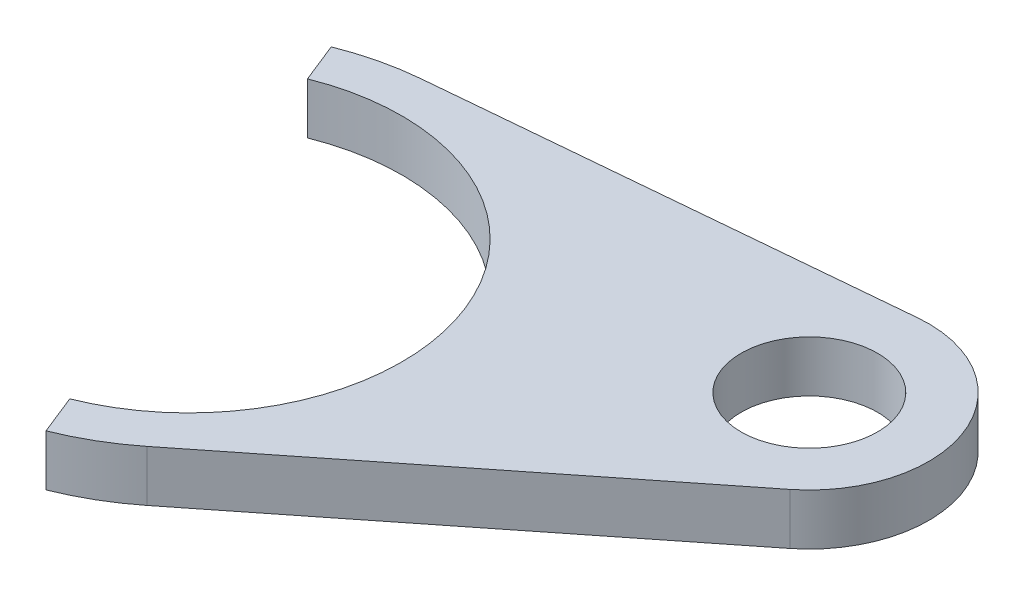
ISO-10303-21;
HEADER;
FILE_DESCRIPTION(('STEP AP214'),'2;1');
FILE_NAME('part.step','',(''),(''),'','','');
FILE_SCHEMA(('AUTOMOTIVE_DESIGN { 1 0 10303 214 1 1 1 1 }'));
ENDSEC;
DATA;
#1=APPLICATION_CONTEXT('core data for automotive mechanical design processes');
#2=APPLICATION_PROTOCOL_DEFINITION('international standard','automotive_design',2000,#1);
#3=PRODUCT_CONTEXT('',#1,'mechanical');
#4=PRODUCT('Part','Part','',(#3));
#5=PRODUCT_RELATED_PRODUCT_CATEGORY('part','',(#4));
#6=PRODUCT_DEFINITION_FORMATION('','',#4);
#7=PRODUCT_DEFINITION_CONTEXT('part definition',#1,'design');
#8=PRODUCT_DEFINITION('design','',#6,#7);
#9=PRODUCT_DEFINITION_SHAPE('','',#8);
#10=(LENGTH_UNIT() NAMED_UNIT(*) SI_UNIT(.MILLI.,.METRE.));
#11=(NAMED_UNIT(*) PLANE_ANGLE_UNIT() SI_UNIT($,.RADIAN.));
#12=(NAMED_UNIT(*) SI_UNIT($,.STERADIAN.) SOLID_ANGLE_UNIT());
#13=UNCERTAINTY_MEASURE_WITH_UNIT(LENGTH_MEASURE(1.E-05),#10,'distance_accuracy_value','');
#14=(GEOMETRIC_REPRESENTATION_CONTEXT(3) GLOBAL_UNCERTAINTY_ASSIGNED_CONTEXT((#13)) GLOBAL_UNIT_ASSIGNED_CONTEXT((#10,
#11,#12)) REPRESENTATION_CONTEXT('',''));
#15=CARTESIAN_POINT('',(0.,0.,0.));
#16=DIRECTION('',(0.,0.,1.));
#17=DIRECTION('',(1.,0.,0.));
#18=AXIS2_PLACEMENT_3D('',#15,#16,#17);
#19=CARTESIAN_POINT('',(-1710.01,3.,402.16));
#20=DIRECTION('',(0.,1.,0.));
#21=DIRECTION('',(0.,0.,1.));
#22=AXIS2_PLACEMENT_3D('',#19,#20,#21);
#23=PLANE('',#22);
#24=CARTESIAN_POINT('',(-1710.01,3.,402.16));
#25=DIRECTION('',(0.,-1.,0.));
#26=DIRECTION('',(0.,0.,1.));
#27=AXIS2_PLACEMENT_3D('',#24,#25,#26);
#28=CIRCLE('',#27,12.5);
#29=CARTESIAN_POINT('',(-1714.64942180599,3.,390.552857142857));
#30=VERTEX_POINT('',#29);
#31=CARTESIAN_POINT('',(-1705.37057819401,3.,413.767142857143));
#32=VERTEX_POINT('',#31);
#33=EDGE_CURVE('E146',#30,#32,#28,.T.);
#34=ORIENTED_EDGE('',*,*,#33,.T.);
#35=DIRECTION('',(0.371153744479083,0.,0.928571428571413));
#36=VECTOR('',#35,1.);
#37=CARTESIAN_POINT('',(-1704.44269383281,3.,416.088571428571));
#38=LINE('',#37,#36);
#39=CARTESIAN_POINT('',(-1704.44269383281,3.,416.088571428571));
#40=VERTEX_POINT('',#39);
#41=EDGE_CURVE('E94',#32,#40,#38,.T.);
#42=ORIENTED_EDGE('',*,*,#41,.T.);
#43=CARTESIAN_POINT('',(-1710.01,3.,402.16));
#44=DIRECTION('',(0.,1.,0.));
#45=DIRECTION('',(0.,0.,1.));
#46=AXIS2_PLACEMENT_3D('',#43,#44,#45);
#47=CIRCLE('',#46,15.);
#48=CARTESIAN_POINT('',(-1700.69517600267,3.,413.917297899553));
#49=VERTEX_POINT('',#48);
#50=EDGE_CURVE('E161',#40,#49,#47,.T.);
#51=ORIENTED_EDGE('',*,*,#50,.T.);
#52=DIRECTION('',(0.783819859970179,0.,-0.62098826648845));
#53=VECTOR('',#52,1.);
#54=CARTESIAN_POINT('',(-1700.69517600267,3.,413.917297899553));
#55=LINE('',#54,#53);
#56=CARTESIAN_POINT('',(-1679.66308213458,3.,397.254434174377));
#57=VERTEX_POINT('',#56);
#58=EDGE_CURVE('E174',#49,#57,#55,.T.);
#59=ORIENTED_EDGE('',*,*,#58,.T.);
#60=CARTESIAN_POINT('',(-1684.01,3.,391.767695154586));
#61=DIRECTION('',(0.,1.,0.));
#62=DIRECTION('',(0.,0.,1.));
#63=AXIS2_PLACEMENT_3D('',#60,#61,#62);
#64=CIRCLE('',#63,6.99999999999996);
#65=CARTESIAN_POINT('',(-1684.64263215113,3.,384.796341156879));
#66=VERTEX_POINT('',#65);
#67=EDGE_CURVE('E113',#57,#66,#64,.T.);
#68=ORIENTED_EDGE('',*,*,#67,.T.);
#69=DIRECTION('',(-0.995907713958213,0.,0.0903760215904947));
#70=VECTOR('',#69,1.);
#71=CARTESIAN_POINT('',(-1711.36564032386,3.,387.221384290627));
#72=LINE('',#71,#70);
#73=CARTESIAN_POINT('',(-1711.36564032386,3.,387.221384290627));
#74=VERTEX_POINT('',#73);
#75=EDGE_CURVE('E107',#66,#74,#72,.T.);
#76=ORIENTED_EDGE('',*,*,#75,.T.);
#77=CARTESIAN_POINT('',(-1710.01,3.,402.16));
#78=DIRECTION('',(0.,1.,0.));
#79=DIRECTION('',(0.,0.,1.));
#80=AXIS2_PLACEMENT_3D('',#77,#78,#79);
#81=CIRCLE('',#80,15.);
#82=CARTESIAN_POINT('',(-1715.57730616719,3.,388.231428571429));
#83=VERTEX_POINT('',#82);
#84=EDGE_CURVE('E111',#74,#83,#81,.T.);
#85=ORIENTED_EDGE('',*,*,#84,.T.);
#86=DIRECTION('',(0.371153744478991,0.,0.92857142857145));
#87=VECTOR('',#86,1.);
#88=CARTESIAN_POINT('',(-1714.64942180599,3.,390.552857142857));
#89=LINE('',#88,#87);
#90=EDGE_CURVE('E51',#83,#30,#89,.T.);
#91=ORIENTED_EDGE('',*,*,#90,.T.);
#92=EDGE_LOOP('',(#34,#42,#51,#59,#68,#76,#85,#91));
#93=FACE_BOUND('',#92,.T.);
#94=CARTESIAN_POINT('',(-1684.01,3.,391.767695154586));
#95=DIRECTION('',(0.,1.,0.));
#96=DIRECTION('',(0.,0.,1.));
#97=AXIS2_PLACEMENT_3D('',#94,#95,#96);
#98=CIRCLE('',#97,3.99999999999999);
#99=CARTESIAN_POINT('',(-1684.01,3.,395.767695154586));
#100=VERTEX_POINT('',#99);
#101=EDGE_CURVE('E135',#100,#100,#98,.T.);
#102=ORIENTED_EDGE('',*,*,#101,.F.);
#103=EDGE_LOOP('',(#102));
#104=FACE_BOUND('',#103,.T.);
#105=ADVANCED_FACE('F34',(#93,#104),#23,.T.);
#106=CARTESIAN_POINT('',(-1710.01,0.,402.16));
#107=DIRECTION('',(0.,1.,0.));
#108=DIRECTION('',(0.,0.,1.));
#109=AXIS2_PLACEMENT_3D('',#106,#107,#108);
#110=PLANE('',#109);
#111=CARTESIAN_POINT('',(-1710.01,0.,402.16));
#112=DIRECTION('',(0.,-1.,0.));
#113=DIRECTION('',(0.,0.,1.));
#114=AXIS2_PLACEMENT_3D('',#111,#112,#113);
#115=CIRCLE('',#114,12.5);
#116=CARTESIAN_POINT('',(-1714.64942180599,0.,390.552857142857));
#117=VERTEX_POINT('',#116);
#118=CARTESIAN_POINT('',(-1705.37057819401,0.,413.767142857143));
#119=VERTEX_POINT('',#118);
#120=EDGE_CURVE('E131',#117,#119,#115,.T.);
#121=ORIENTED_EDGE('',*,*,#120,.F.);
#122=DIRECTION('',(0.371153744478991,0.,0.92857142857145));
#123=VECTOR('',#122,1.);
#124=CARTESIAN_POINT('',(-1714.64942180599,0.,390.552857142857));
#125=LINE('',#124,#123);
#126=CARTESIAN_POINT('',(-1715.57730616719,0.,388.231428571429));
#127=VERTEX_POINT('',#126);
#128=EDGE_CURVE('E86',#127,#117,#125,.T.);
#129=ORIENTED_EDGE('',*,*,#128,.F.);
#130=CARTESIAN_POINT('',(-1710.01,0.,402.16));
#131=DIRECTION('',(0.,1.,0.));
#132=DIRECTION('',(0.,0.,1.));
#133=AXIS2_PLACEMENT_3D('',#130,#131,#132);
#134=CIRCLE('',#133,15.);
#135=CARTESIAN_POINT('',(-1711.36564032386,0.,387.221384290627));
#136=VERTEX_POINT('',#135);
#137=EDGE_CURVE('E80',#136,#127,#134,.T.);
#138=ORIENTED_EDGE('',*,*,#137,.F.);
#139=DIRECTION('',(-0.995907713958213,0.,0.0903760215904947));
#140=VECTOR('',#139,1.);
#141=CARTESIAN_POINT('',(-1711.36564032386,0.,387.221384290627));
#142=LINE('',#141,#140);
#143=CARTESIAN_POINT('',(-1684.64263215113,0.,384.796341156879));
#144=VERTEX_POINT('',#143);
#145=EDGE_CURVE('E121',#144,#136,#142,.T.);
#146=ORIENTED_EDGE('',*,*,#145,.F.);
#147=CARTESIAN_POINT('',(-1684.01,0.,391.767695154586));
#148=DIRECTION('',(0.,1.,0.));
#149=DIRECTION('',(0.,0.,1.));
#150=AXIS2_PLACEMENT_3D('',#147,#148,#149);
#151=CIRCLE('',#150,6.99999999999996);
#152=CARTESIAN_POINT('',(-1679.66308213458,0.,397.254434174377));
#153=VERTEX_POINT('',#152);
#154=EDGE_CURVE('E141',#153,#144,#151,.T.);
#155=ORIENTED_EDGE('',*,*,#154,.F.);
#156=DIRECTION('',(0.783819859970179,0.,-0.62098826648845));
#157=VECTOR('',#156,1.);
#158=CARTESIAN_POINT('',(-1700.69517600267,0.,413.917297899553));
#159=LINE('',#158,#157);
#160=CARTESIAN_POINT('',(-1700.69517600267,0.,413.917297899553));
#161=VERTEX_POINT('',#160);
#162=EDGE_CURVE('E139',#161,#153,#159,.T.);
#163=ORIENTED_EDGE('',*,*,#162,.F.);
#164=CARTESIAN_POINT('',(-1710.01,0.,402.16));
#165=DIRECTION('',(0.,1.,0.));
#166=DIRECTION('',(0.,0.,1.));
#167=AXIS2_PLACEMENT_3D('',#164,#165,#166);
#168=CIRCLE('',#167,15.);
#169=CARTESIAN_POINT('',(-1704.44269383281,0.,416.088571428571));
#170=VERTEX_POINT('',#169);
#171=EDGE_CURVE('E137',#170,#161,#168,.T.);
#172=ORIENTED_EDGE('',*,*,#171,.F.);
#173=DIRECTION('',(0.371153744479083,0.,0.928571428571413));
#174=VECTOR('',#173,1.);
#175=CARTESIAN_POINT('',(-1704.44269383281,0.,416.088571428571));
#176=LINE('',#175,#174);
#177=EDGE_CURVE('E134',#119,#170,#176,.T.);
#178=ORIENTED_EDGE('',*,*,#177,.F.);
#179=EDGE_LOOP('',(#121,#129,#138,#146,#155,#163,#172,#178));
#180=FACE_BOUND('',#179,.T.);
#181=CARTESIAN_POINT('',(-1684.01,0.,391.767695154586));
#182=DIRECTION('',(0.,1.,0.));
#183=DIRECTION('',(0.,0.,1.));
#184=AXIS2_PLACEMENT_3D('',#181,#182,#183);
#185=CIRCLE('',#184,3.99999999999999);
#186=CARTESIAN_POINT('',(-1684.01,0.,395.767695154586));
#187=VERTEX_POINT('',#186);
#188=EDGE_CURVE('E180',#187,#187,#185,.T.);
#189=ORIENTED_EDGE('',*,*,#188,.T.);
#190=EDGE_LOOP('',(#189));
#191=FACE_BOUND('',#190,.T.);
#192=ADVANCED_FACE('F165',(#180,#191),#110,.F.);
#193=CARTESIAN_POINT('',(-1710.01,3.,402.16));
#194=DIRECTION('',(0.,-1.,0.));
#195=DIRECTION('',(0.,0.,-1.));
#196=AXIS2_PLACEMENT_3D('',#193,#194,#195);
#197=CYLINDRICAL_SURFACE('',#196,12.5);
#198=ORIENTED_EDGE('',*,*,#120,.T.);
#199=DIRECTION('',(0.,-1.,0.));
#200=VECTOR('',#199,1.);
#201=CARTESIAN_POINT('',(-1705.37057819401,3.,413.767142857143));
#202=LINE('',#201,#200);
#203=EDGE_CURVE('E11',#32,#119,#202,.T.);
#204=ORIENTED_EDGE('',*,*,#203,.F.);
#205=ORIENTED_EDGE('',*,*,#33,.F.);
#206=DIRECTION('',(0.,-1.,0.));
#207=VECTOR('',#206,1.);
#208=CARTESIAN_POINT('',(-1714.64942180599,3.,390.552857142857));
#209=LINE('',#208,#207);
#210=EDGE_CURVE('E127',#30,#117,#209,.T.);
#211=ORIENTED_EDGE('',*,*,#210,.T.);
#212=EDGE_LOOP('',(#198,#204,#205,#211));
#213=FACE_BOUND('',#212,.T.);
#214=ADVANCED_FACE('F36',(#213),#197,.F.);
#215=CARTESIAN_POINT('',(-1704.44269383281,3.,416.088571428571));
#216=DIRECTION('',(0.928571428571413,0.,-0.371153744479083));
#217=DIRECTION('',(-0.371153744479083,0.,-0.928571428571414));
#218=AXIS2_PLACEMENT_3D('',#215,#216,#217);
#219=PLANE('',#218);
#220=ORIENTED_EDGE('',*,*,#177,.T.);
#221=DIRECTION('',(0.,-1.,0.));
#222=VECTOR('',#221,1.);
#223=CARTESIAN_POINT('',(-1704.44269383281,3.,416.088571428571));
#224=LINE('',#223,#222);
#225=EDGE_CURVE('E43',#40,#170,#224,.T.);
#226=ORIENTED_EDGE('',*,*,#225,.F.);
#227=ORIENTED_EDGE('',*,*,#41,.F.);
#228=ORIENTED_EDGE('',*,*,#203,.T.);
#229=EDGE_LOOP('',(#220,#226,#227,#228));
#230=FACE_BOUND('',#229,.T.);
#231=ADVANCED_FACE('F208',(#230),#219,.F.);
#232=CARTESIAN_POINT('',(-1710.01,3.,402.16));
#233=DIRECTION('',(0.,-1.,0.));
#234=DIRECTION('',(0.,0.,-1.));
#235=AXIS2_PLACEMENT_3D('',#232,#233,#234);
#236=CYLINDRICAL_SURFACE('',#235,15.);
#237=ORIENTED_EDGE('',*,*,#171,.T.);
#238=DIRECTION('',(0.,-1.,0.));
#239=VECTOR('',#238,1.);
#240=CARTESIAN_POINT('',(-1700.69517600267,3.,413.917297899553));
#241=LINE('',#240,#239);
#242=EDGE_CURVE('E153',#49,#161,#241,.T.);
#243=ORIENTED_EDGE('',*,*,#242,.F.);
#244=ORIENTED_EDGE('',*,*,#50,.F.);
#245=ORIENTED_EDGE('',*,*,#225,.T.);
#246=EDGE_LOOP('',(#237,#243,#244,#245));
#247=FACE_BOUND('',#246,.T.);
#248=ADVANCED_FACE('F159',(#247),#236,.T.);
#249=CARTESIAN_POINT('',(-1700.69517600267,3.,413.917297899553));
#250=DIRECTION('',(-0.620988266488449,0.,-0.783819859970179));
#251=DIRECTION('',(-0.783819859970179,0.,0.62098826648845));
#252=AXIS2_PLACEMENT_3D('',#249,#250,#251);
#253=PLANE('',#252);
#254=ORIENTED_EDGE('',*,*,#162,.T.);
#255=DIRECTION('',(0.,-1.,0.));
#256=VECTOR('',#255,1.);
#257=CARTESIAN_POINT('',(-1679.66308213458,3.,397.254434174377));
#258=LINE('',#257,#256);
#259=EDGE_CURVE('E150',#57,#153,#258,.T.);
#260=ORIENTED_EDGE('',*,*,#259,.F.);
#261=ORIENTED_EDGE('',*,*,#58,.F.);
#262=ORIENTED_EDGE('',*,*,#242,.T.);
#263=EDGE_LOOP('',(#254,#260,#261,#262));
#264=FACE_BOUND('',#263,.T.);
#265=ADVANCED_FACE('F170',(#264),#253,.F.);
#266=CARTESIAN_POINT('',(-1684.01,3.,391.767695154586));
#267=DIRECTION('',(0.,-1.,0.));
#268=DIRECTION('',(0.,0.,-1.));
#269=AXIS2_PLACEMENT_3D('',#266,#267,#268);
#270=CYLINDRICAL_SURFACE('',#269,6.99999999999996);
#271=ORIENTED_EDGE('',*,*,#154,.T.);
#272=DIRECTION('',(0.,-1.,0.));
#273=VECTOR('',#272,1.);
#274=CARTESIAN_POINT('',(-1684.64263215113,3.,384.796341156879));
#275=LINE('',#274,#273);
#276=EDGE_CURVE('E122',#66,#144,#275,.T.);
#277=ORIENTED_EDGE('',*,*,#276,.F.);
#278=ORIENTED_EDGE('',*,*,#67,.F.);
#279=ORIENTED_EDGE('',*,*,#259,.T.);
#280=EDGE_LOOP('',(#271,#277,#278,#279));
#281=FACE_BOUND('',#280,.T.);
#282=ADVANCED_FACE('F173',(#281),#270,.T.);
#283=CARTESIAN_POINT('',(-1711.36564032386,3.,387.221384290627));
#284=DIRECTION('',(0.0903760215904947,0.,0.995907713958213));
#285=DIRECTION('',(0.995907713958213,0.,-0.0903760215904947));
#286=AXIS2_PLACEMENT_3D('',#283,#284,#285);
#287=PLANE('',#286);
#288=ORIENTED_EDGE('',*,*,#145,.T.);
#289=DIRECTION('',(0.,-1.,0.));
#290=VECTOR('',#289,1.);
#291=CARTESIAN_POINT('',(-1711.36564032386,3.,387.221384290627));
#292=LINE('',#291,#290);
#293=EDGE_CURVE('E118',#74,#136,#292,.T.);
#294=ORIENTED_EDGE('',*,*,#293,.F.);
#295=ORIENTED_EDGE('',*,*,#75,.F.);
#296=ORIENTED_EDGE('',*,*,#276,.T.);
#297=EDGE_LOOP('',(#288,#294,#295,#296));
#298=FACE_BOUND('',#297,.T.);
#299=ADVANCED_FACE('F119',(#298),#287,.F.);
#300=CARTESIAN_POINT('',(-1710.01,3.,402.16));
#301=DIRECTION('',(0.,-1.,0.));
#302=DIRECTION('',(0.,0.,-1.));
#303=AXIS2_PLACEMENT_3D('',#300,#301,#302);
#304=CYLINDRICAL_SURFACE('',#303,15.);
#305=ORIENTED_EDGE('',*,*,#137,.T.);
#306=DIRECTION('',(0.,-1.,0.));
#307=VECTOR('',#306,1.);
#308=CARTESIAN_POINT('',(-1715.57730616719,3.,388.231428571429));
#309=LINE('',#308,#307);
#310=EDGE_CURVE('E123',#83,#127,#309,.T.);
#311=ORIENTED_EDGE('',*,*,#310,.F.);
#312=ORIENTED_EDGE('',*,*,#84,.F.);
#313=ORIENTED_EDGE('',*,*,#293,.T.);
#314=EDGE_LOOP('',(#305,#311,#312,#313));
#315=FACE_BOUND('',#314,.T.);
#316=ADVANCED_FACE('F125',(#315),#304,.T.);
#317=CARTESIAN_POINT('',(-1714.64942180599,3.,390.552857142857));
#318=DIRECTION('',(0.92857142857145,0.,-0.371153744478991));
#319=DIRECTION('',(-0.371153744478991,0.,-0.92857142857145));
#320=AXIS2_PLACEMENT_3D('',#317,#318,#319);
#321=PLANE('',#320);
#322=ORIENTED_EDGE('',*,*,#128,.T.);
#323=ORIENTED_EDGE('',*,*,#210,.F.);
#324=ORIENTED_EDGE('',*,*,#90,.F.);
#325=ORIENTED_EDGE('',*,*,#310,.T.);
#326=EDGE_LOOP('',(#322,#323,#324,#325));
#327=FACE_BOUND('',#326,.T.);
#328=ADVANCED_FACE('F196',(#327),#321,.F.);
#329=CARTESIAN_POINT('',(-1684.01,3.,391.767695154586));
#330=DIRECTION('',(0.,-1.,0.));
#331=DIRECTION('',(0.,0.,-1.));
#332=AXIS2_PLACEMENT_3D('',#329,#330,#331);
#333=CYLINDRICAL_SURFACE('',#332,3.99999999999999);
#334=ORIENTED_EDGE('',*,*,#101,.T.);
#335=EDGE_LOOP('',(#334));
#336=FACE_BOUND('',#335,.T.);
#337=ORIENTED_EDGE('',*,*,#188,.F.);
#338=EDGE_LOOP('',(#337));
#339=FACE_BOUND('',#338,.T.);
#340=ADVANCED_FACE('F186',(#336,#339),#333,.F.);
#341=CLOSED_SHELL('',(#105,#192,#214,#231,#248,#265,#282,#299,#316,#328,#340));
#342=MANIFOLD_SOLID_BREP('B2',#341);
#343=ADVANCED_BREP_SHAPE_REPRESENTATION('',(#18,#342),#14);
#344=SHAPE_DEFINITION_REPRESENTATION(#9,#343);
ENDSEC;
END-ISO-10303-21;
